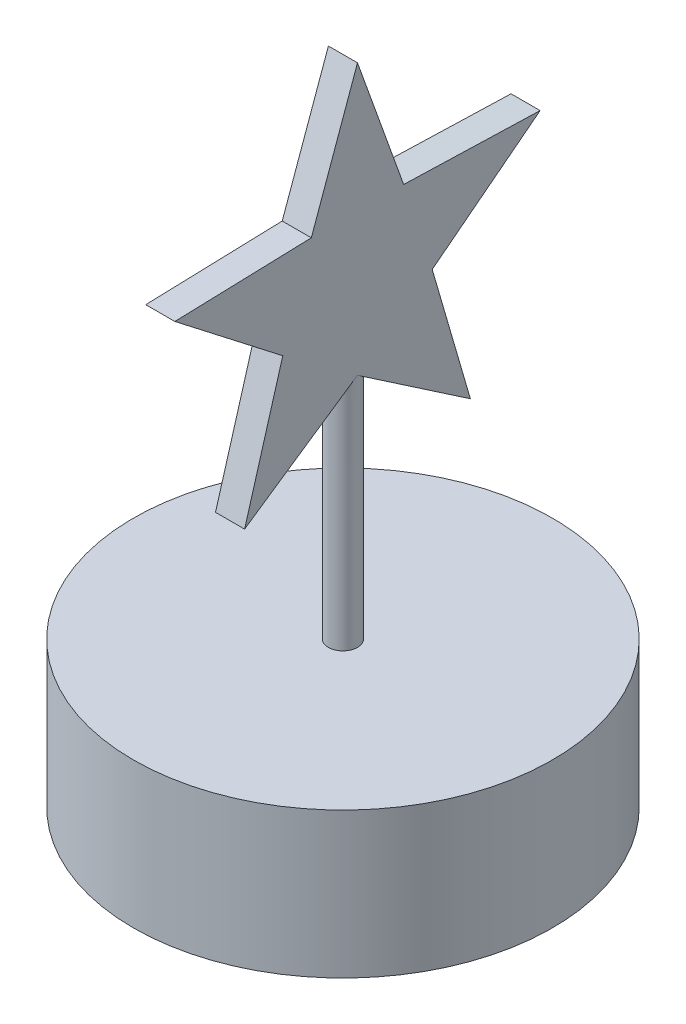
ISO-10303-21;
HEADER;
FILE_DESCRIPTION(('STEP AP214'),'2;1');
FILE_NAME('part.step','',(''),(''),'','','');
FILE_SCHEMA(('AUTOMOTIVE_DESIGN { 1 0 10303 214 1 1 1 1 }'));
ENDSEC;
DATA;
#1=APPLICATION_CONTEXT('core data for automotive mechanical design processes');
#2=APPLICATION_PROTOCOL_DEFINITION('international standard','automotive_design',2000,#1);
#3=PRODUCT_CONTEXT('',#1,'mechanical');
#4=PRODUCT('Part','Part','',(#3));
#5=PRODUCT_RELATED_PRODUCT_CATEGORY('part','',(#4));
#6=PRODUCT_DEFINITION_FORMATION('','',#4);
#7=PRODUCT_DEFINITION_CONTEXT('part definition',#1,'design');
#8=PRODUCT_DEFINITION('design','',#6,#7);
#9=PRODUCT_DEFINITION_SHAPE('','',#8);
#10=(LENGTH_UNIT() NAMED_UNIT(*) SI_UNIT(.MILLI.,.METRE.));
#11=(NAMED_UNIT(*) PLANE_ANGLE_UNIT() SI_UNIT($,.RADIAN.));
#12=(NAMED_UNIT(*) SI_UNIT($,.STERADIAN.) SOLID_ANGLE_UNIT());
#13=UNCERTAINTY_MEASURE_WITH_UNIT(LENGTH_MEASURE(1.E-05),#10,'distance_accuracy_value','');
#14=(GEOMETRIC_REPRESENTATION_CONTEXT(3) GLOBAL_UNCERTAINTY_ASSIGNED_CONTEXT((#13)) GLOBAL_UNIT_ASSIGNED_CONTEXT((#10,
#11,#12)) REPRESENTATION_CONTEXT('',''));
#15=CARTESIAN_POINT('',(0.,0.,0.));
#16=DIRECTION('',(0.,0.,1.));
#17=DIRECTION('',(1.,0.,0.));
#18=AXIS2_PLACEMENT_3D('',#15,#16,#17);
#19=CARTESIAN_POINT('',(0.,112.,0.));
#20=DIRECTION('',(0.,0.338225996397563,0.941064915593433));
#21=DIRECTION('',(0.,-0.941064915593433,0.338225996397563));
#22=AXIS2_PLACEMENT_3D('',#19,#20,#21);
#23=PLANE('',#22);
#24=DIRECTION('',(1.,0.,0.));
#25=VECTOR('',#24,1.);
#26=CARTESIAN_POINT('',(0.,112.,0.));
#27=LINE('',#26,#25);
#28=CARTESIAN_POINT('',(-2.5,112.,0.));
#29=VERTEX_POINT('',#28);
#30=CARTESIAN_POINT('',(2.5,112.,0.));
#31=VERTEX_POINT('',#30);
#32=EDGE_CURVE('E182',#29,#31,#27,.T.);
#33=ORIENTED_EDGE('',*,*,#32,.F.);
#34=DIRECTION('',(0.,0.941064915593433,-0.338225996397563));
#35=VECTOR('',#34,1.);
#36=CARTESIAN_POINT('',(-2.5,89.9217294240618,7.93510090594838));
#37=LINE('',#36,#35);
#38=CARTESIAN_POINT('',(-2.5,89.9217294240618,7.93510090594838));
#39=VERTEX_POINT('',#38);
#40=EDGE_CURVE('E155',#39,#29,#37,.T.);
#41=ORIENTED_EDGE('',*,*,#40,.F.);
#42=DIRECTION('',(1.,0.,0.));
#43=VECTOR('',#42,1.);
#44=CARTESIAN_POINT('',(0.,89.9217294240618,7.93510090594838));
#45=LINE('',#44,#43);
#46=CARTESIAN_POINT('',(2.5,89.9217294240618,7.93510090594838));
#47=VERTEX_POINT('',#46);
#48=EDGE_CURVE('E164',#47,#39,#45,.F.);
#49=ORIENTED_EDGE('',*,*,#48,.F.);
#50=DIRECTION('',(0.,-0.941064915593433,0.338225996397563));
#51=VECTOR('',#50,1.);
#52=CARTESIAN_POINT('',(2.5,112.,0.));
#53=LINE('',#52,#51);
#54=EDGE_CURVE('E163',#31,#47,#53,.T.);
#55=ORIENTED_EDGE('',*,*,#54,.F.);
#56=EDGE_LOOP('',(#33,#41,#49,#55));
#57=FACE_BOUND('',#56,.T.);
#58=ADVANCED_FACE('F17',(#57),#23,.T.);
#59=CARTESIAN_POINT('',(0.,89.9217294240618,-7.93510090594839));
#60=DIRECTION('',(0.,0.338225996397563,-0.941064915593433));
#61=DIRECTION('',(0.,0.941064915593433,0.338225996397563));
#62=AXIS2_PLACEMENT_3D('',#59,#60,#61);
#63=PLANE('',#62);
#64=DIRECTION('',(1.,0.,0.));
#65=VECTOR('',#64,1.);
#66=CARTESIAN_POINT('',(0.,89.9217294240619,-7.93510090594839));
#67=LINE('',#66,#65);
#68=CARTESIAN_POINT('',(-2.5,89.9217294240618,-7.93510090594839));
#69=VERTEX_POINT('',#68);
#70=CARTESIAN_POINT('',(2.5,89.9217294240618,-7.93510090594839));
#71=VERTEX_POINT('',#70);
#72=EDGE_CURVE('E174',#69,#71,#67,.T.);
#73=ORIENTED_EDGE('',*,*,#72,.F.);
#74=DIRECTION('',(0.,-0.941064915593433,-0.338225996397563));
#75=VECTOR('',#74,1.);
#76=CARTESIAN_POINT('',(-2.5,112.,0.));
#77=LINE('',#76,#75);
#78=EDGE_CURVE('E178',#29,#69,#77,.T.);
#79=ORIENTED_EDGE('',*,*,#78,.F.);
#80=ORIENTED_EDGE('',*,*,#32,.T.);
#81=DIRECTION('',(0.,0.941064915593433,0.338225996397563));
#82=VECTOR('',#81,1.);
#83=CARTESIAN_POINT('',(2.5,89.9217294240618,-7.93510090594839));
#84=LINE('',#83,#82);
#85=EDGE_CURVE('E142',#71,#31,#84,.T.);
#86=ORIENTED_EDGE('',*,*,#85,.F.);
#87=EDGE_LOOP('',(#73,#79,#80,#86));
#88=FACE_BOUND('',#87,.T.);
#89=ADVANCED_FACE('F263',(#88),#63,.T.);
#90=CARTESIAN_POINT('',(0.,89.1975608143733,-31.3848650377401));
#91=DIRECTION('',(0.,0.99952350105813,-0.0308669861259276));
#92=DIRECTION('',(0.,0.0308669861259276,0.99952350105813));
#93=AXIS2_PLACEMENT_3D('',#90,#91,#92);
#94=PLANE('',#93);
#95=DIRECTION('',(1.,0.,0.));
#96=VECTOR('',#95,1.);
#97=CARTESIAN_POINT('',(0.,89.1975608143733,-31.3848650377401));
#98=LINE('',#97,#96);
#99=CARTESIAN_POINT('',(-2.5,89.1975608143733,-31.3848650377401));
#100=VERTEX_POINT('',#99);
#101=CARTESIAN_POINT('',(2.5,89.1975608143733,-31.3848650377401));
#102=VERTEX_POINT('',#101);
#103=EDGE_CURVE('E171',#100,#102,#98,.T.);
#104=ORIENTED_EDGE('',*,*,#103,.F.);
#105=DIRECTION('',(0.,-0.0308669861259255,-0.99952350105813));
#106=VECTOR('',#105,1.);
#107=CARTESIAN_POINT('',(-2.5,89.9217294240618,-7.93510090594839));
#108=LINE('',#107,#106);
#109=EDGE_CURVE('E168',#69,#100,#108,.T.);
#110=ORIENTED_EDGE('',*,*,#109,.F.);
#111=ORIENTED_EDGE('',*,*,#72,.T.);
#112=DIRECTION('',(0.,0.0308669861259255,0.99952350105813));
#113=VECTOR('',#112,1.);
#114=CARTESIAN_POINT('',(2.5,89.1975608143733,-31.3848650377401));
#115=LINE('',#114,#113);
#116=EDGE_CURVE('E209',#102,#71,#115,.T.);
#117=ORIENTED_EDGE('',*,*,#116,.F.);
#118=EDGE_LOOP('',(#104,#110,#111,#117));
#119=FACE_BOUND('',#118,.T.);
#120=ADVANCED_FACE('F267',(#119),#94,.T.);
#121=CARTESIAN_POINT('',(0.,74.8282705759382,-12.8392629699846));
#122=DIRECTION('',(0.,-0.790488339405637,-0.61247708958272));
#123=DIRECTION('',(0.,0.61247708958272,-0.790488339405637));
#124=AXIS2_PLACEMENT_3D('',#121,#122,#123);
#125=PLANE('',#124);
#126=DIRECTION('',(1.,0.,0.));
#127=VECTOR('',#126,1.);
#128=CARTESIAN_POINT('',(0.,74.8282705759382,-12.8392629699846));
#129=LINE('',#128,#127);
#130=CARTESIAN_POINT('',(-2.5,74.8282705759382,-12.8392629699846));
#131=VERTEX_POINT('',#130);
#132=CARTESIAN_POINT('',(2.5,74.8282705759382,-12.8392629699846));
#133=VERTEX_POINT('',#132);
#134=EDGE_CURVE('E161',#131,#133,#129,.T.);
#135=ORIENTED_EDGE('',*,*,#134,.F.);
#136=DIRECTION('',(0.,-0.612477089582721,0.790488339405636));
#137=VECTOR('',#136,1.);
#138=CARTESIAN_POINT('',(-2.5,89.1975608143733,-31.3848650377401));
#139=LINE('',#138,#137);
#140=EDGE_CURVE('E102',#100,#131,#139,.T.);
#141=ORIENTED_EDGE('',*,*,#140,.F.);
#142=ORIENTED_EDGE('',*,*,#103,.T.);
#143=DIRECTION('',(0.,0.612477089582721,-0.790488339405636));
#144=VECTOR('',#143,1.);
#145=CARTESIAN_POINT('',(2.5,74.8282705759382,-12.8392629699846));
#146=LINE('',#145,#144);
#147=EDGE_CURVE('E146',#133,#102,#146,.T.);
#148=ORIENTED_EDGE('',*,*,#147,.F.);
#149=EDGE_LOOP('',(#135,#141,#142,#148));
#150=FACE_BOUND('',#149,.T.);
#151=ADVANCED_FACE('F270',(#150),#125,.T.);
#152=CARTESIAN_POINT('',(0.,89.1975608143733,31.3848650377401));
#153=DIRECTION('',(0.,-0.790488339405637,0.61247708958272));
#154=DIRECTION('',(0.,-0.61247708958272,-0.790488339405637));
#155=AXIS2_PLACEMENT_3D('',#152,#153,#154);
#156=PLANE('',#155);
#157=DIRECTION('',(1.,0.,0.));
#158=VECTOR('',#157,1.);
#159=CARTESIAN_POINT('',(0.,89.1975608143733,31.3848650377401));
#160=LINE('',#159,#158);
#161=CARTESIAN_POINT('',(-2.5,89.1975608143733,31.3848650377401));
#162=VERTEX_POINT('',#161);
#163=CARTESIAN_POINT('',(2.5,89.1975608143733,31.3848650377401));
#164=VERTEX_POINT('',#163);
#165=EDGE_CURVE('E173',#162,#164,#160,.T.);
#166=ORIENTED_EDGE('',*,*,#165,.F.);
#167=DIRECTION('',(0.,0.612477089582721,0.790488339405636));
#168=VECTOR('',#167,1.);
#169=CARTESIAN_POINT('',(-2.5,74.8282705759382,12.8392629699846));
#170=LINE('',#169,#168);
#171=CARTESIAN_POINT('',(-2.5,74.8282705759382,12.8392629699846));
#172=VERTEX_POINT('',#171);
#173=EDGE_CURVE('E120',#172,#162,#170,.T.);
#174=ORIENTED_EDGE('',*,*,#173,.F.);
#175=DIRECTION('',(1.,0.,0.));
#176=VECTOR('',#175,1.);
#177=CARTESIAN_POINT('',(0.,74.8282705759382,12.8392629699846));
#178=LINE('',#177,#176);
#179=CARTESIAN_POINT('',(2.5,74.8282705759382,12.8392629699846));
#180=VERTEX_POINT('',#179);
#181=EDGE_CURVE('E141',#180,#172,#178,.F.);
#182=ORIENTED_EDGE('',*,*,#181,.F.);
#183=DIRECTION('',(0.,-0.612477089582721,-0.790488339405636));
#184=VECTOR('',#183,1.);
#185=CARTESIAN_POINT('',(2.5,89.1975608143733,31.3848650377401));
#186=LINE('',#185,#184);
#187=EDGE_CURVE('E147',#164,#180,#186,.T.);
#188=ORIENTED_EDGE('',*,*,#187,.F.);
#189=EDGE_LOOP('',(#166,#174,#182,#188));
#190=FACE_BOUND('',#189,.T.);
#191=ADVANCED_FACE('F254',(#190),#156,.T.);
#192=CARTESIAN_POINT('',(0.,89.9217294240618,7.93510090594838));
#193=DIRECTION('',(0.,0.99952350105813,0.0308669861259268));
#194=DIRECTION('',(0.,-0.0308669861259268,0.99952350105813));
#195=AXIS2_PLACEMENT_3D('',#192,#193,#194);
#196=PLANE('',#195);
#197=ORIENTED_EDGE('',*,*,#48,.T.);
#198=DIRECTION('',(0.,0.0308669861259255,-0.99952350105813));
#199=VECTOR('',#198,1.);
#200=CARTESIAN_POINT('',(-2.5,89.1975608143733,31.3848650377401));
#201=LINE('',#200,#199);
#202=EDGE_CURVE('E117',#162,#39,#201,.T.);
#203=ORIENTED_EDGE('',*,*,#202,.F.);
#204=ORIENTED_EDGE('',*,*,#165,.T.);
#205=DIRECTION('',(0.,-0.0308669861259255,0.99952350105813));
#206=VECTOR('',#205,1.);
#207=CARTESIAN_POINT('',(2.5,89.9217294240618,7.93510090594838));
#208=LINE('',#207,#206);
#209=EDGE_CURVE('E204',#47,#164,#208,.T.);
#210=ORIENTED_EDGE('',*,*,#209,.F.);
#211=EDGE_LOOP('',(#197,#203,#204,#210));
#212=FACE_BOUND('',#211,.T.);
#213=ADVANCED_FACE('F258',(#212),#196,.T.);
#214=CARTESIAN_POINT('',(0.,52.3024391856267,-19.3969133256516));
#215=DIRECTION('',(0.,0.279513499810653,-0.960141762149528));
#216=DIRECTION('',(0.,0.960141762149528,0.279513499810653));
#217=AXIS2_PLACEMENT_3D('',#214,#215,#216);
#218=PLANE('',#217);
#219=DIRECTION('',(1.,0.,0.));
#220=VECTOR('',#219,1.);
#221=CARTESIAN_POINT('',(0.,52.3024391856267,-19.3969133256516));
#222=LINE('',#221,#220);
#223=CARTESIAN_POINT('',(-2.5,52.3024391856267,-19.3969133256516));
#224=VERTEX_POINT('',#223);
#225=CARTESIAN_POINT('',(2.5,52.3024391856267,-19.3969133256516));
#226=VERTEX_POINT('',#225);
#227=EDGE_CURVE('E107',#224,#226,#222,.T.);
#228=ORIENTED_EDGE('',*,*,#227,.F.);
#229=DIRECTION('',(0.,-0.960141762149528,-0.279513499810651));
#230=VECTOR('',#229,1.);
#231=CARTESIAN_POINT('',(-2.5,74.8282705759382,-12.8392629699846));
#232=LINE('',#231,#230);
#233=EDGE_CURVE('E96',#131,#224,#232,.T.);
#234=ORIENTED_EDGE('',*,*,#233,.F.);
#235=ORIENTED_EDGE('',*,*,#134,.T.);
#236=DIRECTION('',(0.,0.960141762149528,0.279513499810651));
#237=VECTOR('',#236,1.);
#238=CARTESIAN_POINT('',(2.5,52.3024391856267,-19.3969133256516));
#239=LINE('',#238,#237);
#240=EDGE_CURVE('E110',#226,#133,#239,.T.);
#241=ORIENTED_EDGE('',*,*,#240,.F.);
#242=EDGE_LOOP('',(#228,#234,#235,#241));
#243=FACE_BOUND('',#242,.T.);
#244=ADVANCED_FACE('F108',(#243),#218,.T.);
#245=CARTESIAN_POINT('',(2.5,79.,0.));
#246=DIRECTION('',(1.,0.,0.));
#247=DIRECTION('',(0.,0.,-1.));
#248=AXIS2_PLACEMENT_3D('',#245,#246,#247);
#249=PLANE('',#248);
#250=ORIENTED_EDGE('',*,*,#116,.T.);
#251=ORIENTED_EDGE('',*,*,#85,.T.);
#252=ORIENTED_EDGE('',*,*,#54,.T.);
#253=ORIENTED_EDGE('',*,*,#209,.T.);
#254=ORIENTED_EDGE('',*,*,#187,.T.);
#255=DIRECTION('',(0.,-0.960141762149528,0.279513499810653));
#256=VECTOR('',#255,1.);
#257=CARTESIAN_POINT('',(2.5,74.8282705759382,12.8392629699846));
#258=LINE('',#257,#256);
#259=CARTESIAN_POINT('',(2.5,52.3024391856267,19.3969133256516));
#260=VERTEX_POINT('',#259);
#261=EDGE_CURVE('E138',#260,#180,#258,.F.);
#262=ORIENTED_EDGE('',*,*,#261,.F.);
#263=DIRECTION('',(0.,0.562533256900698,-0.826774657860709));
#264=VECTOR('',#263,1.);
#265=CARTESIAN_POINT('',(2.5,52.3024391856267,19.3969133256516));
#266=LINE('',#265,#264);
#267=CARTESIAN_POINT('',(2.5,65.5,0.));
#268=VERTEX_POINT('',#267);
#269=EDGE_CURVE('E33',#268,#260,#266,.F.);
#270=ORIENTED_EDGE('',*,*,#269,.F.);
#271=DIRECTION('',(0.,-0.562533256900698,-0.826774657860709));
#272=VECTOR('',#271,1.);
#273=CARTESIAN_POINT('',(2.5,65.5,0.));
#274=LINE('',#273,#272);
#275=EDGE_CURVE('E112',#226,#268,#274,.F.);
#276=ORIENTED_EDGE('',*,*,#275,.F.);
#277=ORIENTED_EDGE('',*,*,#240,.T.);
#278=ORIENTED_EDGE('',*,*,#147,.T.);
#279=EDGE_LOOP('',(#250,#251,#252,#253,#254,#262,#270,#276,#277,#278));
#280=FACE_BOUND('',#279,.T.);
#281=ADVANCED_FACE('F271',(#280),#249,.T.);
#282=CARTESIAN_POINT('',(0.,74.8282705759382,12.8392629699846));
#283=DIRECTION('',(0.,0.279513499810653,0.960141762149528));
#284=DIRECTION('',(0.,-0.960141762149528,0.279513499810653));
#285=AXIS2_PLACEMENT_3D('',#282,#283,#284);
#286=PLANE('',#285);
#287=ORIENTED_EDGE('',*,*,#181,.T.);
#288=DIRECTION('',(0.,0.960141762149528,-0.279513499810651));
#289=VECTOR('',#288,1.);
#290=CARTESIAN_POINT('',(-2.5,52.3024391856267,19.3969133256516));
#291=LINE('',#290,#289);
#292=CARTESIAN_POINT('',(-2.5,52.3024391856267,19.3969133256516));
#293=VERTEX_POINT('',#292);
#294=EDGE_CURVE('E104',#293,#172,#291,.T.);
#295=ORIENTED_EDGE('',*,*,#294,.F.);
#296=DIRECTION('',(1.,0.,0.));
#297=VECTOR('',#296,1.);
#298=CARTESIAN_POINT('',(0.,52.3024391856267,19.3969133256516));
#299=LINE('',#298,#297);
#300=EDGE_CURVE('E132',#260,#293,#299,.F.);
#301=ORIENTED_EDGE('',*,*,#300,.F.);
#302=ORIENTED_EDGE('',*,*,#261,.T.);
#303=EDGE_LOOP('',(#287,#295,#301,#302));
#304=FACE_BOUND('',#303,.T.);
#305=ADVANCED_FACE('F249',(#304),#286,.T.);
#306=CARTESIAN_POINT('',(-2.5,79.,0.));
#307=DIRECTION('',(-1.,0.,0.));
#308=DIRECTION('',(0.,0.,1.));
#309=AXIS2_PLACEMENT_3D('',#306,#307,#308);
#310=PLANE('',#309);
#311=ORIENTED_EDGE('',*,*,#173,.T.);
#312=ORIENTED_EDGE('',*,*,#202,.T.);
#313=ORIENTED_EDGE('',*,*,#40,.T.);
#314=ORIENTED_EDGE('',*,*,#78,.T.);
#315=ORIENTED_EDGE('',*,*,#109,.T.);
#316=ORIENTED_EDGE('',*,*,#140,.T.);
#317=ORIENTED_EDGE('',*,*,#233,.T.);
#318=DIRECTION('',(0.,-0.562533256900698,-0.826774657860709));
#319=VECTOR('',#318,1.);
#320=CARTESIAN_POINT('',(-2.5,65.5,0.));
#321=LINE('',#320,#319);
#322=CARTESIAN_POINT('',(-2.5,65.5,0.));
#323=VERTEX_POINT('',#322);
#324=EDGE_CURVE('E41',#323,#224,#321,.T.);
#325=ORIENTED_EDGE('',*,*,#324,.F.);
#326=DIRECTION('',(0.,0.562533256900698,-0.826774657860709));
#327=VECTOR('',#326,1.);
#328=CARTESIAN_POINT('',(-2.5,52.3024391856267,19.3969133256516));
#329=LINE('',#328,#327);
#330=EDGE_CURVE('E135',#293,#323,#329,.T.);
#331=ORIENTED_EDGE('',*,*,#330,.F.);
#332=ORIENTED_EDGE('',*,*,#294,.T.);
#333=EDGE_LOOP('',(#311,#312,#313,#314,#315,#316,#317,#325,#331,#332));
#334=FACE_BOUND('',#333,.T.);
#335=ADVANCED_FACE('F99',(#334),#310,.T.);
#336=CARTESIAN_POINT('',(0.,65.5,0.));
#337=DIRECTION('',(0.,-0.826774657860709,0.562533256900698));
#338=DIRECTION('',(0.,-0.562533256900698,-0.826774657860709));
#339=AXIS2_PLACEMENT_3D('',#336,#337,#338);
#340=PLANE('',#339);
#341=ORIENTED_EDGE('',*,*,#227,.T.);
#342=ORIENTED_EDGE('',*,*,#275,.T.);
#343=CARTESIAN_POINT('',(0.,65.5,0.));
#344=DIRECTION('',(0.,-0.826774657860709,0.562533256900698));
#345=DIRECTION('',(0.,0.562533256900698,0.826774657860709));
#346=AXIS2_PLACEMENT_3D('',#343,#344,#345);
#347=ELLIPSE('',#346,3.02379853595027,2.5);
#348=EDGE_CURVE('E20',#323,#268,#347,.T.);
#349=ORIENTED_EDGE('',*,*,#348,.F.);
#350=ORIENTED_EDGE('',*,*,#324,.T.);
#351=EDGE_LOOP('',(#341,#342,#349,#350));
#352=FACE_BOUND('',#351,.T.);
#353=ADVANCED_FACE('F114',(#352),#340,.T.);
#354=CARTESIAN_POINT('',(0.,52.3024391856267,19.3969133256516));
#355=DIRECTION('',(0.,-0.826774657860709,-0.562533256900698));
#356=DIRECTION('',(0.,0.562533256900698,-0.826774657860709));
#357=AXIS2_PLACEMENT_3D('',#354,#355,#356);
#358=PLANE('',#357);
#359=ORIENTED_EDGE('',*,*,#300,.T.);
#360=ORIENTED_EDGE('',*,*,#330,.T.);
#361=CARTESIAN_POINT('',(0.,65.4999999999999,0.));
#362=DIRECTION('',(0.,-0.826774657860709,-0.562533256900698));
#363=DIRECTION('',(0.,0.562533256900698,-0.826774657860709));
#364=AXIS2_PLACEMENT_3D('',#361,#362,#363);
#365=ELLIPSE('',#364,3.02379853595027,2.5);
#366=EDGE_CURVE('E235',#268,#323,#365,.T.);
#367=ORIENTED_EDGE('',*,*,#366,.F.);
#368=ORIENTED_EDGE('',*,*,#269,.T.);
#369=EDGE_LOOP('',(#359,#360,#367,#368));
#370=FACE_BOUND('',#369,.T.);
#371=ADVANCED_FACE('F246',(#370),#358,.T.);
#372=CARTESIAN_POINT('',(0.,25.,0.));
#373=DIRECTION('',(0.,1.,0.));
#374=DIRECTION('',(0.,0.,1.));
#375=AXIS2_PLACEMENT_3D('',#372,#373,#374);
#376=CYLINDRICAL_SURFACE('',#375,2.5);
#377=CARTESIAN_POINT('',(0.,25.,0.));
#378=DIRECTION('',(0.,1.,0.));
#379=DIRECTION('',(0.,0.,1.));
#380=AXIS2_PLACEMENT_3D('',#377,#378,#379);
#381=CIRCLE('',#380,2.5);
#382=CARTESIAN_POINT('',(0.,25.,2.5));
#383=VERTEX_POINT('',#382);
#384=EDGE_CURVE('E233',#383,#383,#381,.F.);
#385=ORIENTED_EDGE('',*,*,#384,.F.);
#386=EDGE_LOOP('',(#385));
#387=FACE_BOUND('',#386,.T.);
#388=ORIENTED_EDGE('',*,*,#348,.T.);
#389=ORIENTED_EDGE('',*,*,#366,.T.);
#390=EDGE_LOOP('',(#388,#389));
#391=FACE_BOUND('',#390,.T.);
#392=ADVANCED_FACE('F296',(#387,#391),#376,.T.);
#393=CARTESIAN_POINT('',(0.,25.,0.));
#394=DIRECTION('',(0.,1.,0.));
#395=DIRECTION('',(0.,0.,1.));
#396=AXIS2_PLACEMENT_3D('',#393,#394,#395);
#397=PLANE('',#396);
#398=ORIENTED_EDGE('',*,*,#384,.T.);
#399=EDGE_LOOP('',(#398));
#400=FACE_BOUND('',#399,.T.);
#401=CARTESIAN_POINT('',(0.,25.,0.));
#402=DIRECTION('',(0.,1.,0.));
#403=DIRECTION('',(0.,0.,1.));
#404=AXIS2_PLACEMENT_3D('',#401,#402,#403);
#405=CIRCLE('',#404,36.);
#406=CARTESIAN_POINT('',(0.,25.,36.));
#407=VERTEX_POINT('',#406);
#408=EDGE_CURVE('E25',#407,#407,#405,.F.);
#409=ORIENTED_EDGE('',*,*,#408,.F.);
#410=EDGE_LOOP('',(#409));
#411=FACE_BOUND('',#410,.T.);
#412=ADVANCED_FACE('F289',(#400,#411),#397,.T.);
#413=CARTESIAN_POINT('',(0.,0.,0.));
#414=DIRECTION('',(0.,1.,0.));
#415=DIRECTION('',(0.,0.,1.));
#416=AXIS2_PLACEMENT_3D('',#413,#414,#415);
#417=PLANE('',#416);
#418=CARTESIAN_POINT('',(0.,0.,0.));
#419=DIRECTION('',(0.,1.,0.));
#420=DIRECTION('',(0.,0.,1.));
#421=AXIS2_PLACEMENT_3D('',#418,#419,#420);
#422=CIRCLE('',#421,36.);
#423=CARTESIAN_POINT('',(0.,0.,36.));
#424=VERTEX_POINT('',#423);
#425=EDGE_CURVE('E11',#424,#424,#422,.T.);
#426=ORIENTED_EDGE('',*,*,#425,.F.);
#427=EDGE_LOOP('',(#426));
#428=FACE_BOUND('',#427,.T.);
#429=ADVANCED_FACE('F283',(#428),#417,.F.);
#430=CARTESIAN_POINT('',(0.,0.,0.));
#431=DIRECTION('',(0.,1.,0.));
#432=DIRECTION('',(0.,0.,1.));
#433=AXIS2_PLACEMENT_3D('',#430,#431,#432);
#434=CYLINDRICAL_SURFACE('',#433,36.);
#435=ORIENTED_EDGE('',*,*,#425,.T.);
#436=EDGE_LOOP('',(#435));
#437=FACE_BOUND('',#436,.T.);
#438=ORIENTED_EDGE('',*,*,#408,.T.);
#439=EDGE_LOOP('',(#438));
#440=FACE_BOUND('',#439,.T.);
#441=ADVANCED_FACE('F281',(#437,#440),#434,.T.);
#442=CLOSED_SHELL('',(#58,#89,#120,#151,#191,#213,#244,#281,#305,#335,#353,#371,#392,#412,#429,#441));
#443=MANIFOLD_SOLID_BREP('B1',#442);
#444=ADVANCED_BREP_SHAPE_REPRESENTATION('',(#18,#443),#14);
#445=SHAPE_DEFINITION_REPRESENTATION(#9,#444);
ENDSEC;
END-ISO-10303-21;
